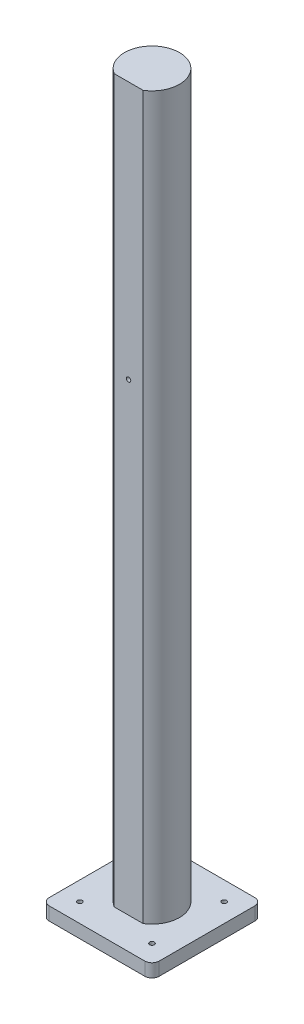
ISO-10303-21;
HEADER;
FILE_DESCRIPTION(('STEP AP214'),'2;1');
FILE_NAME('part.step','',(''),(''),'','','');
FILE_SCHEMA(('AUTOMOTIVE_DESIGN { 1 0 10303 214 1 1 1 1 }'));
ENDSEC;
DATA;
#1=APPLICATION_CONTEXT('core data for automotive mechanical design processes');
#2=APPLICATION_PROTOCOL_DEFINITION('international standard','automotive_design',2000,#1);
#3=PRODUCT_CONTEXT('',#1,'mechanical');
#4=PRODUCT('Part','Part','',(#3));
#5=PRODUCT_RELATED_PRODUCT_CATEGORY('part','',(#4));
#6=PRODUCT_DEFINITION_FORMATION('','',#4);
#7=PRODUCT_DEFINITION_CONTEXT('part definition',#1,'design');
#8=PRODUCT_DEFINITION('design','',#6,#7);
#9=PRODUCT_DEFINITION_SHAPE('','',#8);
#10=(LENGTH_UNIT() NAMED_UNIT(*) SI_UNIT(.MILLI.,.METRE.));
#11=(NAMED_UNIT(*) PLANE_ANGLE_UNIT() SI_UNIT($,.RADIAN.));
#12=(NAMED_UNIT(*) SI_UNIT($,.STERADIAN.) SOLID_ANGLE_UNIT());
#13=UNCERTAINTY_MEASURE_WITH_UNIT(LENGTH_MEASURE(1.E-05),#10,'distance_accuracy_value','');
#14=(GEOMETRIC_REPRESENTATION_CONTEXT(3) GLOBAL_UNCERTAINTY_ASSIGNED_CONTEXT((#13)) GLOBAL_UNIT_ASSIGNED_CONTEXT((#10,
#11,#12)) REPRESENTATION_CONTEXT('',''));
#15=CARTESIAN_POINT('',(0.,0.,0.));
#16=DIRECTION('',(0.,0.,1.));
#17=DIRECTION('',(1.,0.,0.));
#18=AXIS2_PLACEMENT_3D('',#15,#16,#17);
#19=CARTESIAN_POINT('',(0.,-9.144,0.));
#20=DIRECTION('',(0.,1.,0.));
#21=DIRECTION('',(0.,0.,1.));
#22=AXIS2_PLACEMENT_3D('',#19,#20,#21);
#23=PLANE('',#22);
#24=CARTESIAN_POINT('',(-33.1,-9.144,33.1));
#25=DIRECTION('',(0.,1.,0.));
#26=DIRECTION('',(0.,0.,1.));
#27=AXIS2_PLACEMENT_3D('',#24,#25,#26);
#28=CIRCLE('',#27,5.);
#29=CARTESIAN_POINT('',(-38.1,-9.144,33.1));
#30=VERTEX_POINT('',#29);
#31=CARTESIAN_POINT('',(-33.1,-9.144,38.1));
#32=VERTEX_POINT('',#31);
#33=EDGE_CURVE('E90',#30,#32,#28,.T.);
#34=ORIENTED_EDGE('',*,*,#33,.F.);
#35=DIRECTION('',(0.,0.,-1.));
#36=VECTOR('',#35,1.);
#37=CARTESIAN_POINT('',(-38.1,-9.144,-38.1));
#38=LINE('',#37,#36);
#39=CARTESIAN_POINT('',(-38.1,-9.144,-33.1));
#40=VERTEX_POINT('',#39);
#41=EDGE_CURVE('E108',#30,#40,#38,.T.);
#42=ORIENTED_EDGE('',*,*,#41,.T.);
#43=CARTESIAN_POINT('',(-33.1,-9.144,-33.1));
#44=DIRECTION('',(0.,1.,0.));
#45=DIRECTION('',(0.,0.,1.));
#46=AXIS2_PLACEMENT_3D('',#43,#44,#45);
#47=CIRCLE('',#46,5.);
#48=CARTESIAN_POINT('',(-33.1,-9.144,-38.1));
#49=VERTEX_POINT('',#48);
#50=EDGE_CURVE('E124',#49,#40,#47,.T.);
#51=ORIENTED_EDGE('',*,*,#50,.F.);
#52=DIRECTION('',(1.,0.,0.));
#53=VECTOR('',#52,1.);
#54=CARTESIAN_POINT('',(-38.1,-9.144,-38.1));
#55=LINE('',#54,#53);
#56=CARTESIAN_POINT('',(33.1,-9.144,-38.1));
#57=VERTEX_POINT('',#56);
#58=EDGE_CURVE('E121',#49,#57,#55,.T.);
#59=ORIENTED_EDGE('',*,*,#58,.T.);
#60=CARTESIAN_POINT('',(33.1,-9.144,-33.1));
#61=DIRECTION('',(0.,1.,0.));
#62=DIRECTION('',(0.,0.,1.));
#63=AXIS2_PLACEMENT_3D('',#60,#61,#62);
#64=CIRCLE('',#63,5.);
#65=CARTESIAN_POINT('',(38.1,-9.144,-33.1));
#66=VERTEX_POINT('',#65);
#67=EDGE_CURVE('E129',#66,#57,#64,.T.);
#68=ORIENTED_EDGE('',*,*,#67,.F.);
#69=DIRECTION('',(0.,0.,1.));
#70=VECTOR('',#69,1.);
#71=CARTESIAN_POINT('',(38.1,-9.144,-38.1));
#72=LINE('',#71,#70);
#73=CARTESIAN_POINT('',(38.1,-9.144,33.1));
#74=VERTEX_POINT('',#73);
#75=EDGE_CURVE('E128',#66,#74,#72,.T.);
#76=ORIENTED_EDGE('',*,*,#75,.T.);
#77=CARTESIAN_POINT('',(33.1,-9.144,33.1));
#78=DIRECTION('',(0.,1.,0.));
#79=DIRECTION('',(0.,0.,1.));
#80=AXIS2_PLACEMENT_3D('',#77,#78,#79);
#81=CIRCLE('',#80,5.);
#82=CARTESIAN_POINT('',(33.1,-9.144,38.1));
#83=VERTEX_POINT('',#82);
#84=EDGE_CURVE('E96',#83,#74,#81,.T.);
#85=ORIENTED_EDGE('',*,*,#84,.F.);
#86=DIRECTION('',(-1.,0.,0.));
#87=VECTOR('',#86,1.);
#88=CARTESIAN_POINT('',(-38.1,-9.144,38.1));
#89=LINE('',#88,#87);
#90=EDGE_CURVE('E93',#83,#32,#89,.T.);
#91=ORIENTED_EDGE('',*,*,#90,.T.);
#92=EDGE_LOOP('',(#34,#42,#51,#59,#68,#76,#85,#91));
#93=FACE_BOUND('',#92,.T.);
#94=CARTESIAN_POINT('',(-25.,-9.144,25.));
#95=DIRECTION('',(0.,-1.,0.));
#96=DIRECTION('',(0.,0.,-1.));
#97=AXIS2_PLACEMENT_3D('',#94,#95,#96);
#98=CIRCLE('',#97,1.65);
#99=CARTESIAN_POINT('',(-25.,-9.144,23.35));
#100=VERTEX_POINT('',#99);
#101=EDGE_CURVE('E127',#100,#100,#98,.F.);
#102=ORIENTED_EDGE('',*,*,#101,.T.);
#103=EDGE_LOOP('',(#102));
#104=FACE_BOUND('',#103,.T.);
#105=CARTESIAN_POINT('',(25.,-9.144,-25.));
#106=DIRECTION('',(0.,-1.,0.));
#107=DIRECTION('',(0.,0.,-1.));
#108=AXIS2_PLACEMENT_3D('',#105,#106,#107);
#109=CIRCLE('',#108,1.65);
#110=CARTESIAN_POINT('',(25.,-9.144,-26.65));
#111=VERTEX_POINT('',#110);
#112=EDGE_CURVE('E177',#111,#111,#109,.F.);
#113=ORIENTED_EDGE('',*,*,#112,.T.);
#114=EDGE_LOOP('',(#113));
#115=FACE_BOUND('',#114,.T.);
#116=CARTESIAN_POINT('',(25.,-9.144,25.));
#117=DIRECTION('',(0.,-1.,0.));
#118=DIRECTION('',(0.,0.,-1.));
#119=AXIS2_PLACEMENT_3D('',#116,#117,#118);
#120=CIRCLE('',#119,1.65);
#121=CARTESIAN_POINT('',(25.,-9.144,23.35));
#122=VERTEX_POINT('',#121);
#123=EDGE_CURVE('E179',#122,#122,#120,.F.);
#124=ORIENTED_EDGE('',*,*,#123,.T.);
#125=EDGE_LOOP('',(#124));
#126=FACE_BOUND('',#125,.T.);
#127=CARTESIAN_POINT('',(-25.,-9.144,-25.));
#128=DIRECTION('',(0.,-1.,0.));
#129=DIRECTION('',(0.,0.,-1.));
#130=AXIS2_PLACEMENT_3D('',#127,#128,#129);
#131=CIRCLE('',#130,1.65);
#132=CARTESIAN_POINT('',(-25.,-9.144,-26.65));
#133=VERTEX_POINT('',#132);
#134=EDGE_CURVE('E20',#133,#133,#131,.F.);
#135=ORIENTED_EDGE('',*,*,#134,.T.);
#136=EDGE_LOOP('',(#135));
#137=FACE_BOUND('',#136,.T.);
#138=ADVANCED_FACE('F17',(#93,#104,#115,#126,#137),#23,.F.);
#139=CARTESIAN_POINT('',(0.,321.4,11.2142684077944));
#140=DIRECTION('',(0.,0.,1.));
#141=DIRECTION('',(1.,0.,0.));
#142=AXIS2_PLACEMENT_3D('',#139,#140,#141);
#143=PLANE('',#142);
#144=CARTESIAN_POINT('',(0.,321.4,11.2142684077944));
#145=DIRECTION('',(0.,0.,1.));
#146=DIRECTION('',(1.,0.,0.));
#147=AXIS2_PLACEMENT_3D('',#144,#145,#146);
#148=CIRCLE('',#147,1.5);
#149=CARTESIAN_POINT('',(1.5,321.4,11.2142684077944));
#150=VERTEX_POINT('',#149);
#151=EDGE_CURVE('E166',#150,#150,#148,.T.);
#152=ORIENTED_EDGE('',*,*,#151,.T.);
#153=EDGE_LOOP('',(#152));
#154=FACE_BOUND('',#153,.T.);
#155=ADVANCED_FACE('F191',(#154),#143,.T.);
#156=CARTESIAN_POINT('',(-25.,4.66690475583121,-25.));
#157=DIRECTION('',(0.,-1.,0.));
#158=DIRECTION('',(0.,0.,-1.));
#159=AXIS2_PLACEMENT_3D('',#156,#157,#158);
#160=CYLINDRICAL_SURFACE('',#159,1.65);
#161=ORIENTED_EDGE('',*,*,#134,.F.);
#162=EDGE_LOOP('',(#161));
#163=FACE_BOUND('',#162,.T.);
#164=CARTESIAN_POINT('',(-25.,0.,-25.));
#165=DIRECTION('',(0.,-1.,0.));
#166=DIRECTION('',(0.,0.,-1.));
#167=AXIS2_PLACEMENT_3D('',#164,#165,#166);
#168=CIRCLE('',#167,1.65);
#169=CARTESIAN_POINT('',(-25.,0.,-26.65));
#170=VERTEX_POINT('',#169);
#171=EDGE_CURVE('E163',#170,#170,#168,.T.);
#172=ORIENTED_EDGE('',*,*,#171,.F.);
#173=EDGE_LOOP('',(#172));
#174=FACE_BOUND('',#173,.T.);
#175=ADVANCED_FACE('F187',(#163,#174),#160,.F.);
#176=CARTESIAN_POINT('',(25.,4.66690475583121,25.));
#177=DIRECTION('',(0.,-1.,0.));
#178=DIRECTION('',(0.,0.,-1.));
#179=AXIS2_PLACEMENT_3D('',#176,#177,#178);
#180=CYLINDRICAL_SURFACE('',#179,1.65);
#181=ORIENTED_EDGE('',*,*,#123,.F.);
#182=EDGE_LOOP('',(#181));
#183=FACE_BOUND('',#182,.T.);
#184=CARTESIAN_POINT('',(25.,0.,25.));
#185=DIRECTION('',(0.,-1.,0.));
#186=DIRECTION('',(0.,0.,-1.));
#187=AXIS2_PLACEMENT_3D('',#184,#185,#186);
#188=CIRCLE('',#187,1.65);
#189=CARTESIAN_POINT('',(25.,0.,23.35));
#190=VERTEX_POINT('',#189);
#191=EDGE_CURVE('E160',#190,#190,#188,.T.);
#192=ORIENTED_EDGE('',*,*,#191,.F.);
#193=EDGE_LOOP('',(#192));
#194=FACE_BOUND('',#193,.T.);
#195=ADVANCED_FACE('F190',(#183,#194),#180,.F.);
#196=CARTESIAN_POINT('',(25.,4.66690475583121,-25.));
#197=DIRECTION('',(0.,-1.,0.));
#198=DIRECTION('',(0.,0.,-1.));
#199=AXIS2_PLACEMENT_3D('',#196,#197,#198);
#200=CYLINDRICAL_SURFACE('',#199,1.65);
#201=ORIENTED_EDGE('',*,*,#112,.F.);
#202=EDGE_LOOP('',(#201));
#203=FACE_BOUND('',#202,.T.);
#204=CARTESIAN_POINT('',(25.,0.,-25.));
#205=DIRECTION('',(0.,-1.,0.));
#206=DIRECTION('',(0.,0.,-1.));
#207=AXIS2_PLACEMENT_3D('',#204,#205,#206);
#208=CIRCLE('',#207,1.65);
#209=CARTESIAN_POINT('',(25.,0.,-26.65));
#210=VERTEX_POINT('',#209);
#211=EDGE_CURVE('E157',#210,#210,#208,.T.);
#212=ORIENTED_EDGE('',*,*,#211,.F.);
#213=EDGE_LOOP('',(#212));
#214=FACE_BOUND('',#213,.T.);
#215=ADVANCED_FACE('F282',(#203,#214),#200,.F.);
#216=CARTESIAN_POINT('',(-25.,4.66690475583121,25.));
#217=DIRECTION('',(0.,-1.,0.));
#218=DIRECTION('',(0.,0.,-1.));
#219=AXIS2_PLACEMENT_3D('',#216,#217,#218);
#220=CYLINDRICAL_SURFACE('',#219,1.65);
#221=ORIENTED_EDGE('',*,*,#101,.F.);
#222=EDGE_LOOP('',(#221));
#223=FACE_BOUND('',#222,.T.);
#224=CARTESIAN_POINT('',(-25.,0.,25.));
#225=DIRECTION('',(0.,-1.,0.));
#226=DIRECTION('',(0.,0.,-1.));
#227=AXIS2_PLACEMENT_3D('',#224,#225,#226);
#228=CIRCLE('',#227,1.65);
#229=CARTESIAN_POINT('',(-25.,0.,23.35));
#230=VERTEX_POINT('',#229);
#231=EDGE_CURVE('E154',#230,#230,#228,.T.);
#232=ORIENTED_EDGE('',*,*,#231,.F.);
#233=EDGE_LOOP('',(#232));
#234=FACE_BOUND('',#233,.T.);
#235=ADVANCED_FACE('F279',(#223,#234),#220,.F.);
#236=CARTESIAN_POINT('',(-38.1,-9.144,-38.1));
#237=DIRECTION('',(1.,0.,0.));
#238=DIRECTION('',(0.,0.,-1.));
#239=AXIS2_PLACEMENT_3D('',#236,#237,#238);
#240=PLANE('',#239);
#241=DIRECTION('',(0.,1.,0.));
#242=VECTOR('',#241,1.);
#243=CARTESIAN_POINT('',(-38.1,-9.144,33.1));
#244=LINE('',#243,#242);
#245=CARTESIAN_POINT('',(-38.1,0.,33.1));
#246=VERTEX_POINT('',#245);
#247=EDGE_CURVE('E101',#246,#30,#244,.F.);
#248=ORIENTED_EDGE('',*,*,#247,.F.);
#249=DIRECTION('',(0.,0.,1.));
#250=VECTOR('',#249,1.);
#251=CARTESIAN_POINT('',(-38.1,0.,0.));
#252=LINE('',#251,#250);
#253=CARTESIAN_POINT('',(-38.1,0.,-33.1));
#254=VERTEX_POINT('',#253);
#255=EDGE_CURVE('E153',#254,#246,#252,.T.);
#256=ORIENTED_EDGE('',*,*,#255,.F.);
#257=DIRECTION('',(0.,1.,0.));
#258=VECTOR('',#257,1.);
#259=CARTESIAN_POINT('',(-38.1,-9.144,-33.1));
#260=LINE('',#259,#258);
#261=EDGE_CURVE('E172',#40,#254,#260,.T.);
#262=ORIENTED_EDGE('',*,*,#261,.F.);
#263=ORIENTED_EDGE('',*,*,#41,.F.);
#264=EDGE_LOOP('',(#248,#256,#262,#263));
#265=FACE_BOUND('',#264,.T.);
#266=ADVANCED_FACE('F249',(#265),#240,.F.);
#267=CARTESIAN_POINT('',(-33.1,-9.144,33.1));
#268=DIRECTION('',(0.,1.,0.));
#269=DIRECTION('',(0.,0.,1.));
#270=AXIS2_PLACEMENT_3D('',#267,#268,#269);
#271=CYLINDRICAL_SURFACE('',#270,5.);
#272=CARTESIAN_POINT('',(-33.1,0.,33.1));
#273=DIRECTION('',(0.,1.,0.));
#274=DIRECTION('',(0.,0.,1.));
#275=AXIS2_PLACEMENT_3D('',#272,#273,#274);
#276=CIRCLE('',#275,5.);
#277=CARTESIAN_POINT('',(-33.1,0.,38.1));
#278=VERTEX_POINT('',#277);
#279=EDGE_CURVE('E151',#246,#278,#276,.T.);
#280=ORIENTED_EDGE('',*,*,#279,.F.);
#281=ORIENTED_EDGE('',*,*,#247,.T.);
#282=ORIENTED_EDGE('',*,*,#33,.T.);
#283=DIRECTION('',(0.,1.,0.));
#284=VECTOR('',#283,1.);
#285=CARTESIAN_POINT('',(-33.1,-9.144,38.1));
#286=LINE('',#285,#284);
#287=EDGE_CURVE('E100',#32,#278,#286,.T.);
#288=ORIENTED_EDGE('',*,*,#287,.T.);
#289=EDGE_LOOP('',(#280,#281,#282,#288));
#290=FACE_BOUND('',#289,.T.);
#291=ADVANCED_FACE('F106',(#290),#271,.T.);
#292=CARTESIAN_POINT('',(-38.1,-9.144,38.1));
#293=DIRECTION('',(0.,0.,-1.));
#294=DIRECTION('',(-1.,0.,0.));
#295=AXIS2_PLACEMENT_3D('',#292,#293,#294);
#296=PLANE('',#295);
#297=ORIENTED_EDGE('',*,*,#287,.F.);
#298=ORIENTED_EDGE('',*,*,#90,.F.);
#299=DIRECTION('',(0.,1.,0.));
#300=VECTOR('',#299,1.);
#301=CARTESIAN_POINT('',(33.1,-9.144,38.1));
#302=LINE('',#301,#300);
#303=CARTESIAN_POINT('',(33.1,0.,38.1));
#304=VERTEX_POINT('',#303);
#305=EDGE_CURVE('E115',#304,#83,#302,.F.);
#306=ORIENTED_EDGE('',*,*,#305,.F.);
#307=DIRECTION('',(1.,0.,0.));
#308=VECTOR('',#307,1.);
#309=CARTESIAN_POINT('',(0.,0.,38.1));
#310=LINE('',#309,#308);
#311=EDGE_CURVE('E112',#278,#304,#310,.T.);
#312=ORIENTED_EDGE('',*,*,#311,.F.);
#313=EDGE_LOOP('',(#297,#298,#306,#312));
#314=FACE_BOUND('',#313,.T.);
#315=ADVANCED_FACE('F110',(#314),#296,.F.);
#316=CARTESIAN_POINT('',(33.1,-9.144,33.1));
#317=DIRECTION('',(0.,1.,0.));
#318=DIRECTION('',(0.,0.,1.));
#319=AXIS2_PLACEMENT_3D('',#316,#317,#318);
#320=CYLINDRICAL_SURFACE('',#319,5.);
#321=CARTESIAN_POINT('',(33.1,0.,33.1));
#322=DIRECTION('',(0.,1.,0.));
#323=DIRECTION('',(0.,0.,1.));
#324=AXIS2_PLACEMENT_3D('',#321,#322,#323);
#325=CIRCLE('',#324,5.);
#326=CARTESIAN_POINT('',(38.1,0.,33.1));
#327=VERTEX_POINT('',#326);
#328=EDGE_CURVE('E148',#304,#327,#325,.T.);
#329=ORIENTED_EDGE('',*,*,#328,.F.);
#330=ORIENTED_EDGE('',*,*,#305,.T.);
#331=ORIENTED_EDGE('',*,*,#84,.T.);
#332=DIRECTION('',(0.,1.,0.));
#333=VECTOR('',#332,1.);
#334=CARTESIAN_POINT('',(38.1,-9.144,33.1));
#335=LINE('',#334,#333);
#336=EDGE_CURVE('E130',#74,#327,#335,.T.);
#337=ORIENTED_EDGE('',*,*,#336,.T.);
#338=EDGE_LOOP('',(#329,#330,#331,#337));
#339=FACE_BOUND('',#338,.T.);
#340=ADVANCED_FACE('F238',(#339),#320,.T.);
#341=CARTESIAN_POINT('',(38.1,-9.144,-38.1));
#342=DIRECTION('',(-1.,0.,0.));
#343=DIRECTION('',(0.,0.,1.));
#344=AXIS2_PLACEMENT_3D('',#341,#342,#343);
#345=PLANE('',#344);
#346=DIRECTION('',(0.,1.,0.));
#347=VECTOR('',#346,1.);
#348=CARTESIAN_POINT('',(38.1,-9.144,-33.1));
#349=LINE('',#348,#347);
#350=CARTESIAN_POINT('',(38.1,0.,-33.1));
#351=VERTEX_POINT('',#350);
#352=EDGE_CURVE('E173',#351,#66,#349,.F.);
#353=ORIENTED_EDGE('',*,*,#352,.F.);
#354=DIRECTION('',(0.,0.,1.));
#355=VECTOR('',#354,1.);
#356=CARTESIAN_POINT('',(38.1,0.,0.));
#357=LINE('',#356,#355);
#358=EDGE_CURVE('E147',#327,#351,#357,.F.);
#359=ORIENTED_EDGE('',*,*,#358,.F.);
#360=ORIENTED_EDGE('',*,*,#336,.F.);
#361=ORIENTED_EDGE('',*,*,#75,.F.);
#362=EDGE_LOOP('',(#353,#359,#360,#361));
#363=FACE_BOUND('',#362,.T.);
#364=ADVANCED_FACE('F262',(#363),#345,.F.);
#365=CARTESIAN_POINT('',(33.1,-9.144,-33.1));
#366=DIRECTION('',(0.,1.,0.));
#367=DIRECTION('',(0.,0.,1.));
#368=AXIS2_PLACEMENT_3D('',#365,#366,#367);
#369=CYLINDRICAL_SURFACE('',#368,5.);
#370=CARTESIAN_POINT('',(33.1,0.,-33.1));
#371=DIRECTION('',(0.,1.,0.));
#372=DIRECTION('',(0.,0.,1.));
#373=AXIS2_PLACEMENT_3D('',#370,#371,#372);
#374=CIRCLE('',#373,5.);
#375=CARTESIAN_POINT('',(33.1,0.,-38.1));
#376=VERTEX_POINT('',#375);
#377=EDGE_CURVE('E144',#351,#376,#374,.T.);
#378=ORIENTED_EDGE('',*,*,#377,.F.);
#379=ORIENTED_EDGE('',*,*,#352,.T.);
#380=ORIENTED_EDGE('',*,*,#67,.T.);
#381=DIRECTION('',(0.,1.,0.));
#382=VECTOR('',#381,1.);
#383=CARTESIAN_POINT('',(33.1,-9.144,-38.1));
#384=LINE('',#383,#382);
#385=EDGE_CURVE('E125',#57,#376,#384,.T.);
#386=ORIENTED_EDGE('',*,*,#385,.T.);
#387=EDGE_LOOP('',(#378,#379,#380,#386));
#388=FACE_BOUND('',#387,.T.);
#389=ADVANCED_FACE('F259',(#388),#369,.T.);
#390=CARTESIAN_POINT('',(-38.1,-9.144,-38.1));
#391=DIRECTION('',(0.,0.,1.));
#392=DIRECTION('',(1.,0.,0.));
#393=AXIS2_PLACEMENT_3D('',#390,#391,#392);
#394=PLANE('',#393);
#395=DIRECTION('',(0.,1.,0.));
#396=VECTOR('',#395,1.);
#397=CARTESIAN_POINT('',(-33.1,-9.144,-38.1));
#398=LINE('',#397,#396);
#399=CARTESIAN_POINT('',(-33.1,0.,-38.1));
#400=VERTEX_POINT('',#399);
#401=EDGE_CURVE('E169',#400,#49,#398,.F.);
#402=ORIENTED_EDGE('',*,*,#401,.F.);
#403=DIRECTION('',(1.,0.,0.));
#404=VECTOR('',#403,1.);
#405=CARTESIAN_POINT('',(0.,0.,-38.1));
#406=LINE('',#405,#404);
#407=EDGE_CURVE('E143',#376,#400,#406,.F.);
#408=ORIENTED_EDGE('',*,*,#407,.F.);
#409=ORIENTED_EDGE('',*,*,#385,.F.);
#410=ORIENTED_EDGE('',*,*,#58,.F.);
#411=EDGE_LOOP('',(#402,#408,#409,#410));
#412=FACE_BOUND('',#411,.T.);
#413=ADVANCED_FACE('F255',(#412),#394,.F.);
#414=CARTESIAN_POINT('',(-33.1,-9.144,-33.1));
#415=DIRECTION('',(0.,1.,0.));
#416=DIRECTION('',(0.,0.,1.));
#417=AXIS2_PLACEMENT_3D('',#414,#415,#416);
#418=CYLINDRICAL_SURFACE('',#417,5.);
#419=CARTESIAN_POINT('',(-33.1,0.,-33.1));
#420=DIRECTION('',(0.,1.,0.));
#421=DIRECTION('',(0.,0.,1.));
#422=AXIS2_PLACEMENT_3D('',#419,#420,#421);
#423=CIRCLE('',#422,5.);
#424=EDGE_CURVE('E140',#400,#254,#423,.T.);
#425=ORIENTED_EDGE('',*,*,#424,.F.);
#426=ORIENTED_EDGE('',*,*,#401,.T.);
#427=ORIENTED_EDGE('',*,*,#50,.T.);
#428=ORIENTED_EDGE('',*,*,#261,.T.);
#429=EDGE_LOOP('',(#425,#426,#427,#428));
#430=FACE_BOUND('',#429,.T.);
#431=ADVANCED_FACE('F251',(#430),#418,.T.);
#432=CARTESIAN_POINT('',(0.,321.4,11.2142684077944));
#433=DIRECTION('',(0.,0.,1.));
#434=DIRECTION('',(1.,0.,0.));
#435=AXIS2_PLACEMENT_3D('',#432,#433,#434);
#436=CYLINDRICAL_SURFACE('',#435,1.5);
#437=ORIENTED_EDGE('',*,*,#151,.F.);
#438=EDGE_LOOP('',(#437));
#439=FACE_BOUND('',#438,.T.);
#440=CARTESIAN_POINT('',(0.,321.4,16.2142684077944));
#441=DIRECTION('',(0.,0.,1.));
#442=DIRECTION('',(1.,0.,0.));
#443=AXIS2_PLACEMENT_3D('',#440,#441,#442);
#444=CIRCLE('',#443,1.5);
#445=CARTESIAN_POINT('',(1.5,321.4,16.2142684077944));
#446=VERTEX_POINT('',#445);
#447=EDGE_CURVE('E136',#446,#446,#444,.T.);
#448=ORIENTED_EDGE('',*,*,#447,.T.);
#449=EDGE_LOOP('',(#448));
#450=FACE_BOUND('',#449,.T.);
#451=ADVANCED_FACE('F208',(#439,#450),#436,.F.);
#452=CARTESIAN_POINT('',(0.,500.,0.));
#453=DIRECTION('',(0.,1.,0.));
#454=DIRECTION('',(0.,0.,1.));
#455=AXIS2_PLACEMENT_3D('',#452,#453,#454);
#456=PLANE('',#455);
#457=CARTESIAN_POINT('',(0.,500.,0.));
#458=DIRECTION('',(0.,-1.,0.));
#459=DIRECTION('',(0.,0.,-1.));
#460=AXIS2_PLACEMENT_3D('',#457,#458,#459);
#461=CIRCLE('',#460,19.05);
#462=CARTESIAN_POINT('',(-10.,500.,16.2142684077944));
#463=VERTEX_POINT('',#462);
#464=CARTESIAN_POINT('',(10.,500.,16.2142684077944));
#465=VERTEX_POINT('',#464);
#466=EDGE_CURVE('E134',#463,#465,#461,.T.);
#467=ORIENTED_EDGE('',*,*,#466,.F.);
#468=DIRECTION('',(-1.,0.,0.));
#469=VECTOR('',#468,1.);
#470=CARTESIAN_POINT('',(-10.,500.,16.2142684077944));
#471=LINE('',#470,#469);
#472=EDGE_CURVE('E139',#463,#465,#471,.F.);
#473=ORIENTED_EDGE('',*,*,#472,.T.);
#474=EDGE_LOOP('',(#467,#473));
#475=FACE_BOUND('',#474,.T.);
#476=ADVANCED_FACE('F198',(#475),#456,.T.);
#477=CARTESIAN_POINT('',(0.,0.,0.));
#478=DIRECTION('',(0.,1.,0.));
#479=DIRECTION('',(0.,0.,1.));
#480=AXIS2_PLACEMENT_3D('',#477,#478,#479);
#481=PLANE('',#480);
#482=DIRECTION('',(-1.,0.,0.));
#483=VECTOR('',#482,1.);
#484=CARTESIAN_POINT('',(-10.,0.,16.2142684077944));
#485=LINE('',#484,#483);
#486=CARTESIAN_POINT('',(10.,0.,16.2142684077944));
#487=VERTEX_POINT('',#486);
#488=CARTESIAN_POINT('',(-10.,0.,16.2142684077944));
#489=VERTEX_POINT('',#488);
#490=EDGE_CURVE('E34',#487,#489,#485,.T.);
#491=ORIENTED_EDGE('',*,*,#490,.T.);
#492=CARTESIAN_POINT('',(0.,0.,0.));
#493=DIRECTION('',(0.,-1.,0.));
#494=DIRECTION('',(0.,0.,-1.));
#495=AXIS2_PLACEMENT_3D('',#492,#493,#494);
#496=CIRCLE('',#495,19.05);
#497=EDGE_CURVE('E26',#487,#489,#496,.F.);
#498=ORIENTED_EDGE('',*,*,#497,.F.);
#499=EDGE_LOOP('',(#491,#498));
#500=FACE_BOUND('',#499,.T.);
#501=ORIENTED_EDGE('',*,*,#407,.T.);
#502=ORIENTED_EDGE('',*,*,#424,.T.);
#503=ORIENTED_EDGE('',*,*,#255,.T.);
#504=ORIENTED_EDGE('',*,*,#279,.T.);
#505=ORIENTED_EDGE('',*,*,#311,.T.);
#506=ORIENTED_EDGE('',*,*,#328,.T.);
#507=ORIENTED_EDGE('',*,*,#358,.T.);
#508=ORIENTED_EDGE('',*,*,#377,.T.);
#509=EDGE_LOOP('',(#501,#502,#503,#504,#505,#506,#507,#508));
#510=FACE_BOUND('',#509,.T.);
#511=ORIENTED_EDGE('',*,*,#231,.T.);
#512=EDGE_LOOP('',(#511));
#513=FACE_BOUND('',#512,.T.);
#514=ORIENTED_EDGE('',*,*,#211,.T.);
#515=EDGE_LOOP('',(#514));
#516=FACE_BOUND('',#515,.T.);
#517=ORIENTED_EDGE('',*,*,#191,.T.);
#518=EDGE_LOOP('',(#517));
#519=FACE_BOUND('',#518,.T.);
#520=ORIENTED_EDGE('',*,*,#171,.T.);
#521=EDGE_LOOP('',(#520));
#522=FACE_BOUND('',#521,.T.);
#523=ADVANCED_FACE('F195',(#500,#510,#513,#516,#519,#522),#481,.T.);
#524=CARTESIAN_POINT('',(-10.,500.,16.2142684077944));
#525=DIRECTION('',(0.,0.,-1.));
#526=DIRECTION('',(-1.,0.,0.));
#527=AXIS2_PLACEMENT_3D('',#524,#525,#526);
#528=PLANE('',#527);
#529=DIRECTION('',(0.,1.,0.));
#530=VECTOR('',#529,1.);
#531=CARTESIAN_POINT('',(10.,500.,16.2142684077944));
#532=LINE('',#531,#530);
#533=EDGE_CURVE('E219',#465,#487,#532,.F.);
#534=ORIENTED_EDGE('',*,*,#533,.F.);
#535=ORIENTED_EDGE('',*,*,#472,.F.);
#536=DIRECTION('',(0.,-1.,0.));
#537=VECTOR('',#536,1.);
#538=CARTESIAN_POINT('',(-10.,500.,16.2142684077944));
#539=LINE('',#538,#537);
#540=EDGE_CURVE('E11',#489,#463,#539,.F.);
#541=ORIENTED_EDGE('',*,*,#540,.F.);
#542=ORIENTED_EDGE('',*,*,#490,.F.);
#543=EDGE_LOOP('',(#534,#535,#541,#542));
#544=FACE_BOUND('',#543,.T.);
#545=ORIENTED_EDGE('',*,*,#447,.F.);
#546=EDGE_LOOP('',(#545));
#547=FACE_BOUND('',#546,.T.);
#548=ADVANCED_FACE('F197',(#544,#547),#528,.F.);
#549=CARTESIAN_POINT('',(0.,500.,0.));
#550=DIRECTION('',(0.,-1.,0.));
#551=DIRECTION('',(0.,0.,-1.));
#552=AXIS2_PLACEMENT_3D('',#549,#550,#551);
#553=CYLINDRICAL_SURFACE('',#552,19.05);
#554=ORIENTED_EDGE('',*,*,#497,.T.);
#555=ORIENTED_EDGE('',*,*,#540,.T.);
#556=ORIENTED_EDGE('',*,*,#466,.T.);
#557=ORIENTED_EDGE('',*,*,#533,.T.);
#558=EDGE_LOOP('',(#554,#555,#556,#557));
#559=FACE_BOUND('',#558,.T.);
#560=ADVANCED_FACE('F205',(#559),#553,.T.);
#561=CLOSED_SHELL('',(#138,#155,#175,#195,#215,#235,#266,#291,#315,#340,#364,#389,#413,#431,
#451,#476,#523,#548,#560));
#562=MANIFOLD_SOLID_BREP('B1',#561);
#563=ADVANCED_BREP_SHAPE_REPRESENTATION('',(#18,#562),#14);
#564=SHAPE_DEFINITION_REPRESENTATION(#9,#563);
ENDSEC;
END-ISO-10303-21;
